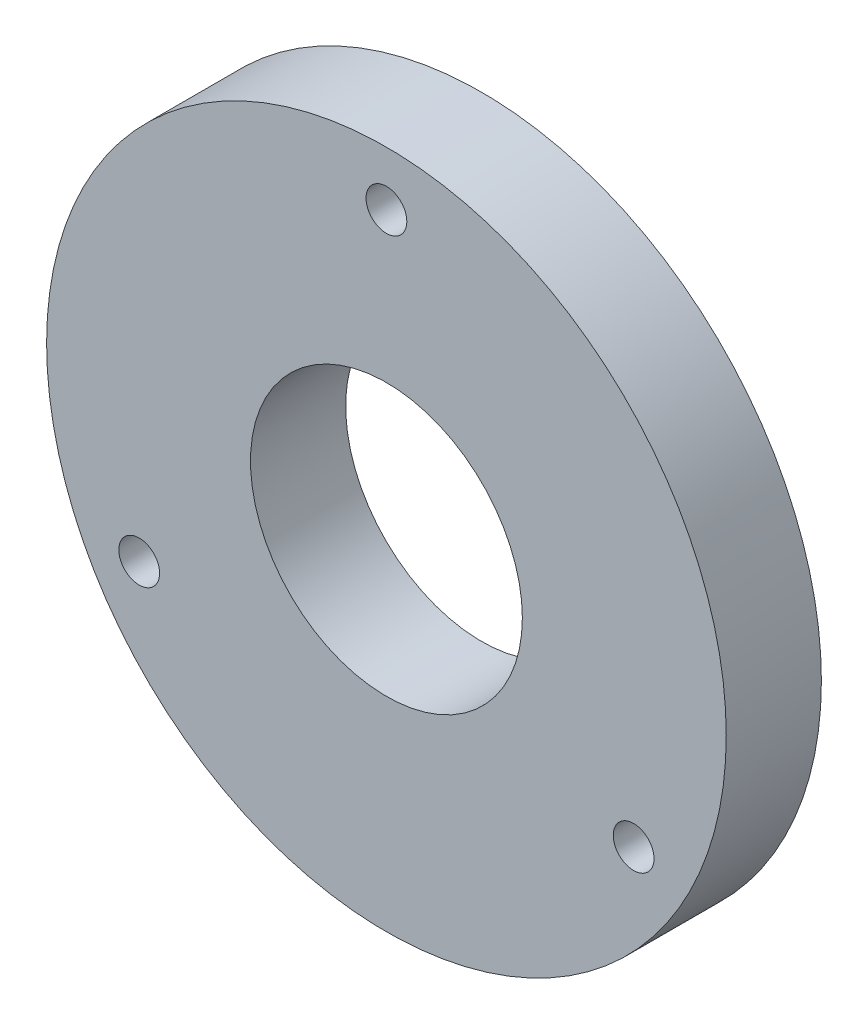
ISO-10303-21;
HEADER;
FILE_DESCRIPTION(('STEP AP214'),'2;1');
FILE_NAME('part.step','',(''),(''),'','','');
FILE_SCHEMA(('AUTOMOTIVE_DESIGN { 1 0 10303 214 1 1 1 1 }'));
ENDSEC;
DATA;
#1=APPLICATION_CONTEXT('core data for automotive mechanical design processes');
#2=APPLICATION_PROTOCOL_DEFINITION('international standard','automotive_design',2000,#1);
#3=PRODUCT_CONTEXT('',#1,'mechanical');
#4=PRODUCT('Part','Part','',(#3));
#5=PRODUCT_RELATED_PRODUCT_CATEGORY('part','',(#4));
#6=PRODUCT_DEFINITION_FORMATION('','',#4);
#7=PRODUCT_DEFINITION_CONTEXT('part definition',#1,'design');
#8=PRODUCT_DEFINITION('design','',#6,#7);
#9=PRODUCT_DEFINITION_SHAPE('','',#8);
#10=(LENGTH_UNIT() NAMED_UNIT(*) SI_UNIT(.MILLI.,.METRE.));
#11=(NAMED_UNIT(*) PLANE_ANGLE_UNIT() SI_UNIT($,.RADIAN.));
#12=(NAMED_UNIT(*) SI_UNIT($,.STERADIAN.) SOLID_ANGLE_UNIT());
#13=UNCERTAINTY_MEASURE_WITH_UNIT(LENGTH_MEASURE(1.E-05),#10,'distance_accuracy_value','');
#14=(GEOMETRIC_REPRESENTATION_CONTEXT(3) GLOBAL_UNCERTAINTY_ASSIGNED_CONTEXT((#13)) GLOBAL_UNIT_ASSIGNED_CONTEXT((#10,
#11,#12)) REPRESENTATION_CONTEXT('',''));
#15=CARTESIAN_POINT('',(0.,0.,0.));
#16=DIRECTION('',(0.,0.,1.));
#17=DIRECTION('',(1.,0.,0.));
#18=AXIS2_PLACEMENT_3D('',#15,#16,#17);
#19=CARTESIAN_POINT('',(0.,0.,7.));
#20=DIRECTION('',(0.,0.,1.));
#21=DIRECTION('',(1.,0.,0.));
#22=AXIS2_PLACEMENT_3D('',#19,#20,#21);
#23=PLANE('',#22);
#24=CARTESIAN_POINT('',(18.1865334794733,-10.4999999999998,7.));
#25=DIRECTION('',(0.,0.,1.));
#26=DIRECTION('',(1.,0.,0.));
#27=AXIS2_PLACEMENT_3D('',#24,#25,#26);
#28=CIRCLE('',#27,1.49999999999999);
#29=CARTESIAN_POINT('',(19.6865334794733,-10.4999999999998,7.));
#30=VERTEX_POINT('',#29);
#31=EDGE_CURVE('E64',#30,#30,#28,.T.);
#32=ORIENTED_EDGE('',*,*,#31,.F.);
#33=EDGE_LOOP('',(#32));
#34=FACE_BOUND('',#33,.T.);
#35=CARTESIAN_POINT('',(-18.1865334794732,-10.5000000000001,7.));
#36=DIRECTION('',(0.,0.,1.));
#37=DIRECTION('',(1.,0.,0.));
#38=AXIS2_PLACEMENT_3D('',#35,#36,#37);
#39=CIRCLE('',#38,1.49999999999999);
#40=CARTESIAN_POINT('',(-16.6865334794732,-10.5000000000001,7.));
#41=VERTEX_POINT('',#40);
#42=EDGE_CURVE('E58',#41,#41,#39,.T.);
#43=ORIENTED_EDGE('',*,*,#42,.F.);
#44=EDGE_LOOP('',(#43));
#45=FACE_BOUND('',#44,.T.);
#46=CARTESIAN_POINT('',(0.,21.,7.));
#47=DIRECTION('',(0.,0.,1.));
#48=DIRECTION('',(1.,0.,0.));
#49=AXIS2_PLACEMENT_3D('',#46,#47,#48);
#50=CIRCLE('',#49,1.49999999999999);
#51=CARTESIAN_POINT('',(1.49999999999999,21.,7.));
#52=VERTEX_POINT('',#51);
#53=EDGE_CURVE('E52',#52,#52,#50,.T.);
#54=ORIENTED_EDGE('',*,*,#53,.F.);
#55=EDGE_LOOP('',(#54));
#56=FACE_BOUND('',#55,.T.);
#57=CARTESIAN_POINT('',(0.,0.,7.));
#58=DIRECTION('',(0.,0.,1.));
#59=DIRECTION('',(1.,0.,0.));
#60=AXIS2_PLACEMENT_3D('',#57,#58,#59);
#61=CIRCLE('',#60,25.);
#62=CARTESIAN_POINT('',(25.,0.,7.));
#63=VERTEX_POINT('',#62);
#64=EDGE_CURVE('E10',#63,#63,#61,.T.);
#65=ORIENTED_EDGE('',*,*,#64,.T.);
#66=EDGE_LOOP('',(#65));
#67=FACE_BOUND('',#66,.T.);
#68=CARTESIAN_POINT('',(0.,0.,7.));
#69=DIRECTION('',(0.,0.,1.));
#70=DIRECTION('',(1.,0.,0.));
#71=AXIS2_PLACEMENT_3D('',#68,#69,#70);
#72=CIRCLE('',#71,10.);
#73=CARTESIAN_POINT('',(10.,0.,7.));
#74=VERTEX_POINT('',#73);
#75=EDGE_CURVE('E42',#74,#74,#72,.T.);
#76=ORIENTED_EDGE('',*,*,#75,.F.);
#77=EDGE_LOOP('',(#76));
#78=FACE_BOUND('',#77,.T.);
#79=ADVANCED_FACE('F31',(#34,#45,#56,#67,#78),#23,.T.);
#80=CARTESIAN_POINT('',(0.,0.,0.));
#81=DIRECTION('',(0.,0.,1.));
#82=DIRECTION('',(1.,0.,0.));
#83=AXIS2_PLACEMENT_3D('',#80,#81,#82);
#84=PLANE('',#83);
#85=CARTESIAN_POINT('',(18.1865334794733,-10.4999999999998,0.));
#86=DIRECTION('',(0.,0.,1.));
#87=DIRECTION('',(1.,0.,0.));
#88=AXIS2_PLACEMENT_3D('',#85,#86,#87);
#89=CIRCLE('',#88,1.5);
#90=CARTESIAN_POINT('',(19.6865334794733,-10.4999999999998,0.));
#91=VERTEX_POINT('',#90);
#92=EDGE_CURVE('E61',#91,#91,#89,.T.);
#93=ORIENTED_EDGE('',*,*,#92,.T.);
#94=EDGE_LOOP('',(#93));
#95=FACE_BOUND('',#94,.T.);
#96=CARTESIAN_POINT('',(-18.1865334794732,-10.5000000000001,0.));
#97=DIRECTION('',(0.,0.,1.));
#98=DIRECTION('',(1.,0.,0.));
#99=AXIS2_PLACEMENT_3D('',#96,#97,#98);
#100=CIRCLE('',#99,1.5);
#101=CARTESIAN_POINT('',(-16.6865334794732,-10.5000000000001,0.));
#102=VERTEX_POINT('',#101);
#103=EDGE_CURVE('E55',#102,#102,#100,.T.);
#104=ORIENTED_EDGE('',*,*,#103,.T.);
#105=EDGE_LOOP('',(#104));
#106=FACE_BOUND('',#105,.T.);
#107=CARTESIAN_POINT('',(0.,21.,0.));
#108=DIRECTION('',(0.,0.,1.));
#109=DIRECTION('',(1.,0.,0.));
#110=AXIS2_PLACEMENT_3D('',#107,#108,#109);
#111=CIRCLE('',#110,1.5);
#112=CARTESIAN_POINT('',(1.5,21.,0.));
#113=VERTEX_POINT('',#112);
#114=EDGE_CURVE('E47',#113,#113,#111,.T.);
#115=ORIENTED_EDGE('',*,*,#114,.T.);
#116=EDGE_LOOP('',(#115));
#117=FACE_BOUND('',#116,.T.);
#118=CARTESIAN_POINT('',(0.,0.,0.));
#119=DIRECTION('',(0.,0.,1.));
#120=DIRECTION('',(1.,0.,0.));
#121=AXIS2_PLACEMENT_3D('',#118,#119,#120);
#122=CIRCLE('',#121,25.);
#123=CARTESIAN_POINT('',(25.,0.,0.));
#124=VERTEX_POINT('',#123);
#125=EDGE_CURVE('E35',#124,#124,#122,.T.);
#126=ORIENTED_EDGE('',*,*,#125,.F.);
#127=EDGE_LOOP('',(#126));
#128=FACE_BOUND('',#127,.T.);
#129=CARTESIAN_POINT('',(0.,0.,0.));
#130=DIRECTION('',(0.,0.,1.));
#131=DIRECTION('',(1.,0.,0.));
#132=AXIS2_PLACEMENT_3D('',#129,#130,#131);
#133=CIRCLE('',#132,10.);
#134=CARTESIAN_POINT('',(10.,0.,0.));
#135=VERTEX_POINT('',#134);
#136=EDGE_CURVE('E44',#135,#135,#133,.T.);
#137=ORIENTED_EDGE('',*,*,#136,.T.);
#138=EDGE_LOOP('',(#137));
#139=FACE_BOUND('',#138,.T.);
#140=ADVANCED_FACE('F72',(#95,#106,#117,#128,#139),#84,.F.);
#141=CARTESIAN_POINT('',(0.,0.,7.));
#142=DIRECTION('',(0.,0.,-1.));
#143=DIRECTION('',(-1.,0.,0.));
#144=AXIS2_PLACEMENT_3D('',#141,#142,#143);
#145=CYLINDRICAL_SURFACE('',#144,25.);
#146=ORIENTED_EDGE('',*,*,#64,.F.);
#147=EDGE_LOOP('',(#146));
#148=FACE_BOUND('',#147,.T.);
#149=ORIENTED_EDGE('',*,*,#125,.T.);
#150=EDGE_LOOP('',(#149));
#151=FACE_BOUND('',#150,.T.);
#152=ADVANCED_FACE('F33',(#148,#151),#145,.T.);
#153=CARTESIAN_POINT('',(0.,0.,7.));
#154=DIRECTION('',(0.,0.,-1.));
#155=DIRECTION('',(-1.,0.,0.));
#156=AXIS2_PLACEMENT_3D('',#153,#154,#155);
#157=CYLINDRICAL_SURFACE('',#156,10.);
#158=ORIENTED_EDGE('',*,*,#75,.T.);
#159=EDGE_LOOP('',(#158));
#160=FACE_BOUND('',#159,.T.);
#161=ORIENTED_EDGE('',*,*,#136,.F.);
#162=EDGE_LOOP('',(#161));
#163=FACE_BOUND('',#162,.T.);
#164=ADVANCED_FACE('F80',(#160,#163),#157,.F.);
#165=CARTESIAN_POINT('',(0.,21.,7.));
#166=DIRECTION('',(0.,0.,1.));
#167=DIRECTION('',(1.,0.,0.));
#168=AXIS2_PLACEMENT_3D('',#165,#166,#167);
#169=CYLINDRICAL_SURFACE('',#168,1.49999999999999);
#170=ORIENTED_EDGE('',*,*,#114,.F.);
#171=EDGE_LOOP('',(#170));
#172=FACE_BOUND('',#171,.T.);
#173=ORIENTED_EDGE('',*,*,#53,.T.);
#174=EDGE_LOOP('',(#173));
#175=FACE_BOUND('',#174,.T.);
#176=ADVANCED_FACE('F83',(#172,#175),#169,.F.);
#177=CARTESIAN_POINT('',(-18.1865334794732,-10.5000000000001,7.));
#178=DIRECTION('',(0.,0.,1.));
#179=DIRECTION('',(1.,0.,0.));
#180=AXIS2_PLACEMENT_3D('',#177,#178,#179);
#181=CYLINDRICAL_SURFACE('',#180,1.49999999999999);
#182=ORIENTED_EDGE('',*,*,#103,.F.);
#183=EDGE_LOOP('',(#182));
#184=FACE_BOUND('',#183,.T.);
#185=ORIENTED_EDGE('',*,*,#42,.T.);
#186=EDGE_LOOP('',(#185));
#187=FACE_BOUND('',#186,.T.);
#188=ADVANCED_FACE('F98',(#184,#187),#181,.F.);
#189=CARTESIAN_POINT('',(18.1865334794733,-10.4999999999998,7.));
#190=DIRECTION('',(0.,0.,1.));
#191=DIRECTION('',(1.,0.,0.));
#192=AXIS2_PLACEMENT_3D('',#189,#190,#191);
#193=CYLINDRICAL_SURFACE('',#192,1.49999999999999);
#194=ORIENTED_EDGE('',*,*,#92,.F.);
#195=EDGE_LOOP('',(#194));
#196=FACE_BOUND('',#195,.T.);
#197=ORIENTED_EDGE('',*,*,#31,.T.);
#198=EDGE_LOOP('',(#197));
#199=FACE_BOUND('',#198,.T.);
#200=ADVANCED_FACE('F68',(#196,#199),#193,.F.);
#201=CLOSED_SHELL('',(#79,#140,#152,#164,#176,#188,#200));
#202=MANIFOLD_SOLID_BREP('B2',#201);
#203=ADVANCED_BREP_SHAPE_REPRESENTATION('',(#18,#202),#14);
#204=SHAPE_DEFINITION_REPRESENTATION(#9,#203);
ENDSEC;
END-ISO-10303-21;
